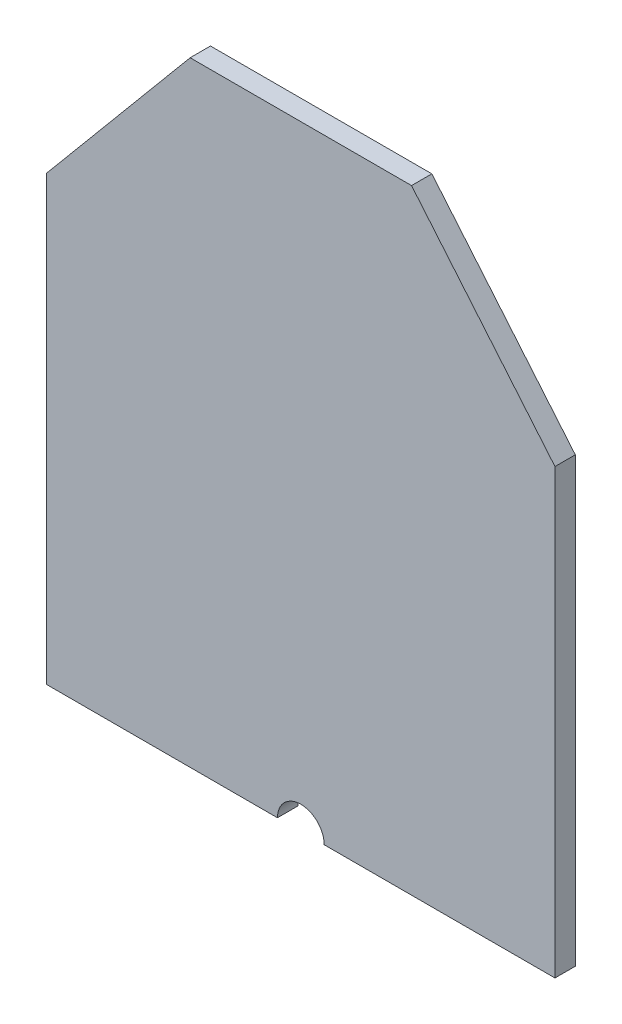
ISO-10303-21;
HEADER;
FILE_DESCRIPTION(('STEP AP214'),'2;1');
FILE_NAME('part.step','',(''),(''),'','','');
FILE_SCHEMA(('AUTOMOTIVE_DESIGN { 1 0 10303 214 1 1 1 1 }'));
ENDSEC;
DATA;
#1=APPLICATION_CONTEXT('core data for automotive mechanical design processes');
#2=APPLICATION_PROTOCOL_DEFINITION('international standard','automotive_design',2000,#1);
#3=PRODUCT_CONTEXT('',#1,'mechanical');
#4=PRODUCT('Part','Part','',(#3));
#5=PRODUCT_RELATED_PRODUCT_CATEGORY('part','',(#4));
#6=PRODUCT_DEFINITION_FORMATION('','',#4);
#7=PRODUCT_DEFINITION_CONTEXT('part definition',#1,'design');
#8=PRODUCT_DEFINITION('design','',#6,#7);
#9=PRODUCT_DEFINITION_SHAPE('','',#8);
#10=(LENGTH_UNIT() NAMED_UNIT(*) SI_UNIT(.MILLI.,.METRE.));
#11=(NAMED_UNIT(*) PLANE_ANGLE_UNIT() SI_UNIT($,.RADIAN.));
#12=(NAMED_UNIT(*) SI_UNIT($,.STERADIAN.) SOLID_ANGLE_UNIT());
#13=UNCERTAINTY_MEASURE_WITH_UNIT(LENGTH_MEASURE(1.E-05),#10,'distance_accuracy_value','');
#14=(GEOMETRIC_REPRESENTATION_CONTEXT(3) GLOBAL_UNCERTAINTY_ASSIGNED_CONTEXT((#13)) GLOBAL_UNIT_ASSIGNED_CONTEXT((#10,
#11,#12)) REPRESENTATION_CONTEXT('',''));
#15=CARTESIAN_POINT('',(0.,0.,0.));
#16=DIRECTION('',(0.,0.,1.));
#17=DIRECTION('',(1.,0.,0.));
#18=AXIS2_PLACEMENT_3D('',#15,#16,#17);
#19=CARTESIAN_POINT('',(-125.,108.94,5.));
#20=DIRECTION('',(1.,0.,0.));
#21=DIRECTION('',(0.,1.,0.));
#22=AXIS2_PLACEMENT_3D('',#19,#20,#21);
#23=PLANE('',#22);
#24=DIRECTION('',(0.,-1.,0.));
#25=VECTOR('',#24,1.);
#26=CARTESIAN_POINT('',(-125.,108.94,-5.));
#27=LINE('',#26,#25);
#28=CARTESIAN_POINT('',(-125.,108.94,-5.));
#29=VERTEX_POINT('',#28);
#30=CARTESIAN_POINT('',(-125.,-108.94,-5.));
#31=VERTEX_POINT('',#30);
#32=EDGE_CURVE('E144',#29,#31,#27,.T.);
#33=ORIENTED_EDGE('',*,*,#32,.T.);
#34=DIRECTION('',(0.,0.,-1.));
#35=VECTOR('',#34,1.);
#36=CARTESIAN_POINT('',(-125.,-108.94,5.));
#37=LINE('',#36,#35);
#38=CARTESIAN_POINT('',(-125.,-108.94,5.));
#39=VERTEX_POINT('',#38);
#40=EDGE_CURVE('E11',#39,#31,#37,.T.);
#41=ORIENTED_EDGE('',*,*,#40,.F.);
#42=DIRECTION('',(0.,-1.,0.));
#43=VECTOR('',#42,1.);
#44=CARTESIAN_POINT('',(-125.,108.94,5.));
#45=LINE('',#44,#43);
#46=CARTESIAN_POINT('',(-125.,108.94,5.));
#47=VERTEX_POINT('',#46);
#48=EDGE_CURVE('E166',#47,#39,#45,.T.);
#49=ORIENTED_EDGE('',*,*,#48,.F.);
#50=DIRECTION('',(0.,0.,-1.));
#51=VECTOR('',#50,1.);
#52=CARTESIAN_POINT('',(-125.,108.94,5.));
#53=LINE('',#52,#51);
#54=EDGE_CURVE('E140',#47,#29,#53,.T.);
#55=ORIENTED_EDGE('',*,*,#54,.T.);
#56=EDGE_LOOP('',(#33,#41,#49,#55));
#57=FACE_BOUND('',#56,.T.);
#58=ADVANCED_FACE('F43',(#57),#23,.F.);
#59=CARTESIAN_POINT('',(-11.5,-108.94,5.));
#60=DIRECTION('',(0.,1.,0.));
#61=DIRECTION('',(-1.,0.,0.));
#62=AXIS2_PLACEMENT_3D('',#59,#60,#61);
#63=PLANE('',#62);
#64=DIRECTION('',(1.,0.,0.));
#65=VECTOR('',#64,1.);
#66=CARTESIAN_POINT('',(-11.5,-108.94,-5.));
#67=LINE('',#66,#65);
#68=CARTESIAN_POINT('',(-11.5,-108.94,-5.));
#69=VERTEX_POINT('',#68);
#70=EDGE_CURVE('E148',#31,#69,#67,.T.);
#71=ORIENTED_EDGE('',*,*,#70,.T.);
#72=DIRECTION('',(0.,0.,-1.));
#73=VECTOR('',#72,1.);
#74=CARTESIAN_POINT('',(-11.5,-108.94,5.));
#75=LINE('',#74,#73);
#76=CARTESIAN_POINT('',(-11.5,-108.94,5.));
#77=VERTEX_POINT('',#76);
#78=EDGE_CURVE('E52',#77,#69,#75,.T.);
#79=ORIENTED_EDGE('',*,*,#78,.F.);
#80=DIRECTION('',(1.,0.,0.));
#81=VECTOR('',#80,1.);
#82=CARTESIAN_POINT('',(-11.5,-108.94,5.));
#83=LINE('',#82,#81);
#84=EDGE_CURVE('E103',#39,#77,#83,.T.);
#85=ORIENTED_EDGE('',*,*,#84,.F.);
#86=ORIENTED_EDGE('',*,*,#40,.T.);
#87=EDGE_LOOP('',(#71,#79,#85,#86));
#88=FACE_BOUND('',#87,.T.);
#89=ADVANCED_FACE('F212',(#88),#63,.F.);
#90=CARTESIAN_POINT('',(0.,-108.94,5.));
#91=DIRECTION('',(0.,0.,-1.));
#92=DIRECTION('',(-1.,0.,0.));
#93=AXIS2_PLACEMENT_3D('',#90,#91,#92);
#94=CYLINDRICAL_SURFACE('',#93,11.5);
#95=CARTESIAN_POINT('',(0.,-108.94,-5.));
#96=DIRECTION('',(0.,0.,-1.));
#97=DIRECTION('',(1.,0.,0.));
#98=AXIS2_PLACEMENT_3D('',#95,#96,#97);
#99=CIRCLE('',#98,11.5);
#100=CARTESIAN_POINT('',(11.5,-108.94,-5.));
#101=VERTEX_POINT('',#100);
#102=EDGE_CURVE('E151',#69,#101,#99,.T.);
#103=ORIENTED_EDGE('',*,*,#102,.T.);
#104=DIRECTION('',(0.,0.,-1.));
#105=VECTOR('',#104,1.);
#106=CARTESIAN_POINT('',(11.5,-108.94,5.));
#107=LINE('',#106,#105);
#108=CARTESIAN_POINT('',(11.5,-108.94,5.));
#109=VERTEX_POINT('',#108);
#110=EDGE_CURVE('E177',#109,#101,#107,.T.);
#111=ORIENTED_EDGE('',*,*,#110,.F.);
#112=CARTESIAN_POINT('',(0.,-108.94,5.));
#113=DIRECTION('',(0.,0.,-1.));
#114=DIRECTION('',(1.,0.,0.));
#115=AXIS2_PLACEMENT_3D('',#112,#113,#114);
#116=CIRCLE('',#115,11.5);
#117=EDGE_CURVE('E187',#77,#109,#116,.T.);
#118=ORIENTED_EDGE('',*,*,#117,.F.);
#119=ORIENTED_EDGE('',*,*,#78,.T.);
#120=EDGE_LOOP('',(#103,#111,#118,#119));
#121=FACE_BOUND('',#120,.T.);
#122=ADVANCED_FACE('F185',(#121),#94,.F.);
#123=CARTESIAN_POINT('',(125.,-108.94,5.));
#124=DIRECTION('',(0.,1.,0.));
#125=DIRECTION('',(-1.,0.,0.));
#126=AXIS2_PLACEMENT_3D('',#123,#124,#125);
#127=PLANE('',#126);
#128=DIRECTION('',(1.,0.,0.));
#129=VECTOR('',#128,1.);
#130=CARTESIAN_POINT('',(125.,-108.94,-5.));
#131=LINE('',#130,#129);
#132=CARTESIAN_POINT('',(125.,-108.94,-5.));
#133=VERTEX_POINT('',#132);
#134=EDGE_CURVE('E154',#101,#133,#131,.T.);
#135=ORIENTED_EDGE('',*,*,#134,.T.);
#136=DIRECTION('',(0.,0.,-1.));
#137=VECTOR('',#136,1.);
#138=CARTESIAN_POINT('',(125.,-108.94,5.));
#139=LINE('',#138,#137);
#140=CARTESIAN_POINT('',(125.,-108.94,5.));
#141=VERTEX_POINT('',#140);
#142=EDGE_CURVE('E173',#141,#133,#139,.T.);
#143=ORIENTED_EDGE('',*,*,#142,.F.);
#144=DIRECTION('',(1.,0.,0.));
#145=VECTOR('',#144,1.);
#146=CARTESIAN_POINT('',(125.,-108.94,5.));
#147=LINE('',#146,#145);
#148=EDGE_CURVE('E200',#109,#141,#147,.T.);
#149=ORIENTED_EDGE('',*,*,#148,.F.);
#150=ORIENTED_EDGE('',*,*,#110,.T.);
#151=EDGE_LOOP('',(#135,#143,#149,#150));
#152=FACE_BOUND('',#151,.T.);
#153=ADVANCED_FACE('F195',(#152),#127,.F.);
#154=CARTESIAN_POINT('',(125.,108.94,5.));
#155=DIRECTION('',(-1.,0.,0.));
#156=DIRECTION('',(0.,-1.,0.));
#157=AXIS2_PLACEMENT_3D('',#154,#155,#156);
#158=PLANE('',#157);
#159=DIRECTION('',(0.,1.,0.));
#160=VECTOR('',#159,1.);
#161=CARTESIAN_POINT('',(125.,108.94,-5.));
#162=LINE('',#161,#160);
#163=CARTESIAN_POINT('',(125.,108.94,-5.));
#164=VERTEX_POINT('',#163);
#165=EDGE_CURVE('E157',#133,#164,#162,.T.);
#166=ORIENTED_EDGE('',*,*,#165,.T.);
#167=DIRECTION('',(0.,0.,-1.));
#168=VECTOR('',#167,1.);
#169=CARTESIAN_POINT('',(125.,108.94,5.));
#170=LINE('',#169,#168);
#171=CARTESIAN_POINT('',(125.,108.94,5.));
#172=VERTEX_POINT('',#171);
#173=EDGE_CURVE('E133',#172,#164,#170,.T.);
#174=ORIENTED_EDGE('',*,*,#173,.F.);
#175=DIRECTION('',(0.,1.,0.));
#176=VECTOR('',#175,1.);
#177=CARTESIAN_POINT('',(125.,108.94,5.));
#178=LINE('',#177,#176);
#179=EDGE_CURVE('E122',#141,#172,#178,.T.);
#180=ORIENTED_EDGE('',*,*,#179,.F.);
#181=ORIENTED_EDGE('',*,*,#142,.T.);
#182=EDGE_LOOP('',(#166,#174,#180,#181));
#183=FACE_BOUND('',#182,.T.);
#184=ADVANCED_FACE('F198',(#183),#158,.F.);
#185=CARTESIAN_POINT('',(125.,108.94,5.));
#186=DIRECTION('',(-0.767289111479314,-0.641301348357607,0.));
#187=DIRECTION('',(0.641301348357607,-0.767289111479314,0.));
#188=AXIS2_PLACEMENT_3D('',#185,#186,#187);
#189=PLANE('',#188);
#190=DIRECTION('',(-0.641301348357607,0.767289111479314,0.));
#191=VECTOR('',#190,1.);
#192=CARTESIAN_POINT('',(125.,108.94,-5.));
#193=LINE('',#192,#191);
#194=CARTESIAN_POINT('',(54.45,193.35,-5.));
#195=VERTEX_POINT('',#194);
#196=EDGE_CURVE('E131',#164,#195,#193,.T.);
#197=ORIENTED_EDGE('',*,*,#196,.T.);
#198=DIRECTION('',(0.,0.,-1.));
#199=VECTOR('',#198,1.);
#200=CARTESIAN_POINT('',(54.45,193.35,5.));
#201=LINE('',#200,#199);
#202=CARTESIAN_POINT('',(54.45,193.35,5.));
#203=VERTEX_POINT('',#202);
#204=EDGE_CURVE('E128',#203,#195,#201,.T.);
#205=ORIENTED_EDGE('',*,*,#204,.F.);
#206=DIRECTION('',(-0.641301348357607,0.767289111479314,0.));
#207=VECTOR('',#206,1.);
#208=CARTESIAN_POINT('',(125.,108.94,5.));
#209=LINE('',#208,#207);
#210=EDGE_CURVE('E116',#172,#203,#209,.T.);
#211=ORIENTED_EDGE('',*,*,#210,.F.);
#212=ORIENTED_EDGE('',*,*,#173,.T.);
#213=EDGE_LOOP('',(#197,#205,#211,#212));
#214=FACE_BOUND('',#213,.T.);
#215=ADVANCED_FACE('F129',(#214),#189,.F.);
#216=CARTESIAN_POINT('',(-54.45,193.35,5.));
#217=DIRECTION('',(0.,-1.,0.));
#218=DIRECTION('',(0.,0.,-1.));
#219=AXIS2_PLACEMENT_3D('',#216,#217,#218);
#220=PLANE('',#219);
#221=DIRECTION('',(-1.,0.,0.));
#222=VECTOR('',#221,1.);
#223=CARTESIAN_POINT('',(-54.45,193.35,-5.));
#224=LINE('',#223,#222);
#225=CARTESIAN_POINT('',(-54.45,193.35,-5.));
#226=VERTEX_POINT('',#225);
#227=EDGE_CURVE('E89',#195,#226,#224,.T.);
#228=ORIENTED_EDGE('',*,*,#227,.T.);
#229=DIRECTION('',(0.,0.,-1.));
#230=VECTOR('',#229,1.);
#231=CARTESIAN_POINT('',(-54.45,193.35,5.));
#232=LINE('',#231,#230);
#233=CARTESIAN_POINT('',(-54.45,193.35,5.));
#234=VERTEX_POINT('',#233);
#235=EDGE_CURVE('E134',#234,#226,#232,.T.);
#236=ORIENTED_EDGE('',*,*,#235,.F.);
#237=DIRECTION('',(-1.,0.,0.));
#238=VECTOR('',#237,1.);
#239=CARTESIAN_POINT('',(-54.45,193.35,5.));
#240=LINE('',#239,#238);
#241=EDGE_CURVE('E120',#203,#234,#240,.T.);
#242=ORIENTED_EDGE('',*,*,#241,.F.);
#243=ORIENTED_EDGE('',*,*,#204,.T.);
#244=EDGE_LOOP('',(#228,#236,#242,#243));
#245=FACE_BOUND('',#244,.T.);
#246=ADVANCED_FACE('F136',(#245),#220,.F.);
#247=CARTESIAN_POINT('',(-125.,108.94,5.));
#248=DIRECTION('',(0.767289111479314,-0.641301348357607,0.));
#249=DIRECTION('',(0.641301348357607,0.767289111479314,0.));
#250=AXIS2_PLACEMENT_3D('',#247,#248,#249);
#251=PLANE('',#250);
#252=DIRECTION('',(-0.641301348357607,-0.767289111479314,0.));
#253=VECTOR('',#252,1.);
#254=CARTESIAN_POINT('',(-125.,108.94,-5.));
#255=LINE('',#254,#253);
#256=EDGE_CURVE('E95',#226,#29,#255,.T.);
#257=ORIENTED_EDGE('',*,*,#256,.T.);
#258=ORIENTED_EDGE('',*,*,#54,.F.);
#259=DIRECTION('',(-0.641301348357607,-0.767289111479314,0.));
#260=VECTOR('',#259,1.);
#261=CARTESIAN_POINT('',(-125.,108.94,5.));
#262=LINE('',#261,#260);
#263=EDGE_CURVE('E60',#234,#47,#262,.T.);
#264=ORIENTED_EDGE('',*,*,#263,.F.);
#265=ORIENTED_EDGE('',*,*,#235,.T.);
#266=EDGE_LOOP('',(#257,#258,#264,#265));
#267=FACE_BOUND('',#266,.T.);
#268=ADVANCED_FACE('F228',(#267),#251,.F.);
#269=CARTESIAN_POINT('',(0.,-108.94,5.));
#270=DIRECTION('',(0.,0.,1.));
#271=DIRECTION('',(1.,0.,0.));
#272=AXIS2_PLACEMENT_3D('',#269,#270,#271);
#273=PLANE('',#272);
#274=ORIENTED_EDGE('',*,*,#48,.T.);
#275=ORIENTED_EDGE('',*,*,#84,.T.);
#276=ORIENTED_EDGE('',*,*,#117,.T.);
#277=ORIENTED_EDGE('',*,*,#148,.T.);
#278=ORIENTED_EDGE('',*,*,#179,.T.);
#279=ORIENTED_EDGE('',*,*,#210,.T.);
#280=ORIENTED_EDGE('',*,*,#241,.T.);
#281=ORIENTED_EDGE('',*,*,#263,.T.);
#282=EDGE_LOOP('',(#274,#275,#276,#277,#278,#279,#280,#281));
#283=FACE_BOUND('',#282,.T.);
#284=ADVANCED_FACE('F118',(#283),#273,.T.);
#285=CARTESIAN_POINT('',(0.,-108.94,-5.));
#286=DIRECTION('',(0.,0.,1.));
#287=DIRECTION('',(1.,0.,0.));
#288=AXIS2_PLACEMENT_3D('',#285,#286,#287);
#289=PLANE('',#288);
#290=ORIENTED_EDGE('',*,*,#32,.F.);
#291=ORIENTED_EDGE('',*,*,#256,.F.);
#292=ORIENTED_EDGE('',*,*,#227,.F.);
#293=ORIENTED_EDGE('',*,*,#196,.F.);
#294=ORIENTED_EDGE('',*,*,#165,.F.);
#295=ORIENTED_EDGE('',*,*,#134,.F.);
#296=ORIENTED_EDGE('',*,*,#102,.F.);
#297=ORIENTED_EDGE('',*,*,#70,.F.);
#298=EDGE_LOOP('',(#290,#291,#292,#293,#294,#295,#296,#297));
#299=FACE_BOUND('',#298,.T.);
#300=ADVANCED_FACE('F191',(#299),#289,.F.);
#301=CLOSED_SHELL('',(#58,#89,#122,#153,#184,#215,#246,#268,#284,#300));
#302=MANIFOLD_SOLID_BREP('B2',#301);
#303=ADVANCED_BREP_SHAPE_REPRESENTATION('',(#18,#302),#14);
#304=SHAPE_DEFINITION_REPRESENTATION(#9,#303);
ENDSEC;
END-ISO-10303-21;
